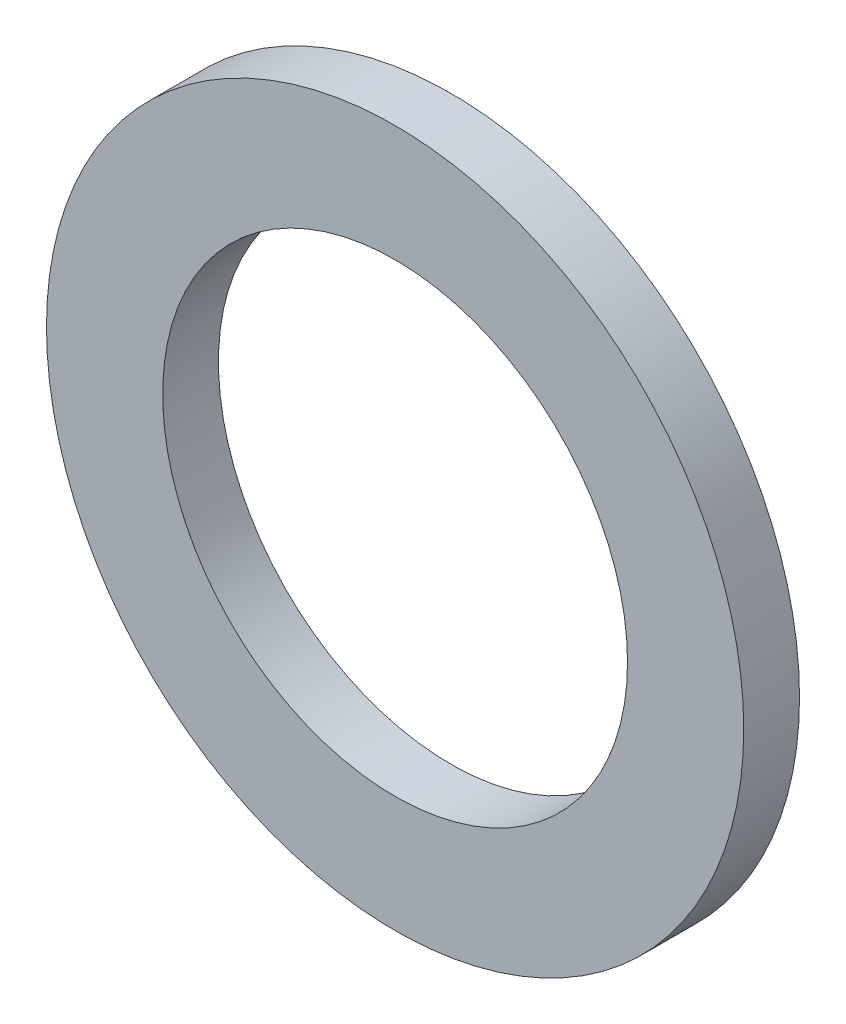
ISO-10303-21;
HEADER;
FILE_DESCRIPTION(('STEP AP214'),'2;1');
FILE_NAME('part.step','',(''),(''),'','','');
FILE_SCHEMA(('AUTOMOTIVE_DESIGN { 1 0 10303 214 1 1 1 1 }'));
ENDSEC;
DATA;
#1=APPLICATION_CONTEXT('core data for automotive mechanical design processes');
#2=APPLICATION_PROTOCOL_DEFINITION('international standard','automotive_design',2000,#1);
#3=PRODUCT_CONTEXT('',#1,'mechanical');
#4=PRODUCT('Part','Part','',(#3));
#5=PRODUCT_RELATED_PRODUCT_CATEGORY('part','',(#4));
#6=PRODUCT_DEFINITION_FORMATION('','',#4);
#7=PRODUCT_DEFINITION_CONTEXT('part definition',#1,'design');
#8=PRODUCT_DEFINITION('design','',#6,#7);
#9=PRODUCT_DEFINITION_SHAPE('','',#8);
#10=(LENGTH_UNIT() NAMED_UNIT(*) SI_UNIT(.MILLI.,.METRE.));
#11=(NAMED_UNIT(*) PLANE_ANGLE_UNIT() SI_UNIT($,.RADIAN.));
#12=(NAMED_UNIT(*) SI_UNIT($,.STERADIAN.) SOLID_ANGLE_UNIT());
#13=UNCERTAINTY_MEASURE_WITH_UNIT(LENGTH_MEASURE(1.E-05),#10,'distance_accuracy_value','');
#14=(GEOMETRIC_REPRESENTATION_CONTEXT(3) GLOBAL_UNCERTAINTY_ASSIGNED_CONTEXT((#13)) GLOBAL_UNIT_ASSIGNED_CONTEXT((#10,
#11,#12)) REPRESENTATION_CONTEXT('',''));
#15=CARTESIAN_POINT('',(0.,0.,0.));
#16=DIRECTION('',(0.,0.,1.));
#17=DIRECTION('',(1.,0.,0.));
#18=AXIS2_PLACEMENT_3D('',#15,#16,#17);
#19=CARTESIAN_POINT('',(0.,0.,0.762));
#20=DIRECTION('',(0.,0.,1.));
#21=DIRECTION('',(1.,0.,0.));
#22=AXIS2_PLACEMENT_3D('',#19,#20,#21);
#23=PLANE('',#22);
#24=CARTESIAN_POINT('',(0.,0.,0.762));
#25=DIRECTION('',(0.,0.,1.));
#26=DIRECTION('',(1.,0.,0.));
#27=AXIS2_PLACEMENT_3D('',#24,#25,#26);
#28=CIRCLE('',#27,4.7625);
#29=CARTESIAN_POINT('',(4.7625,0.,0.762));
#30=VERTEX_POINT('',#29);
#31=EDGE_CURVE('E10',#30,#30,#28,.T.);
#32=ORIENTED_EDGE('',*,*,#31,.T.);
#33=EDGE_LOOP('',(#32));
#34=FACE_BOUND('',#33,.T.);
#35=CARTESIAN_POINT('',(0.,0.,0.762));
#36=DIRECTION('',(0.,0.,1.));
#37=DIRECTION('',(1.,0.,0.));
#38=AXIS2_PLACEMENT_3D('',#35,#36,#37);
#39=CIRCLE('',#38,3.175);
#40=CARTESIAN_POINT('',(3.175,0.,0.762));
#41=VERTEX_POINT('',#40);
#42=EDGE_CURVE('E42',#41,#41,#39,.T.);
#43=ORIENTED_EDGE('',*,*,#42,.F.);
#44=EDGE_LOOP('',(#43));
#45=FACE_BOUND('',#44,.T.);
#46=ADVANCED_FACE('F31',(#34,#45),#23,.T.);
#47=CARTESIAN_POINT('',(0.,0.,0.));
#48=DIRECTION('',(0.,0.,1.));
#49=DIRECTION('',(1.,0.,0.));
#50=AXIS2_PLACEMENT_3D('',#47,#48,#49);
#51=PLANE('',#50);
#52=CARTESIAN_POINT('',(0.,0.,0.));
#53=DIRECTION('',(0.,0.,1.));
#54=DIRECTION('',(1.,0.,0.));
#55=AXIS2_PLACEMENT_3D('',#52,#53,#54);
#56=CIRCLE('',#55,4.7625);
#57=CARTESIAN_POINT('',(4.7625,0.,0.));
#58=VERTEX_POINT('',#57);
#59=EDGE_CURVE('E35',#58,#58,#56,.T.);
#60=ORIENTED_EDGE('',*,*,#59,.F.);
#61=EDGE_LOOP('',(#60));
#62=FACE_BOUND('',#61,.T.);
#63=CARTESIAN_POINT('',(0.,0.,0.));
#64=DIRECTION('',(0.,0.,1.));
#65=DIRECTION('',(1.,0.,0.));
#66=AXIS2_PLACEMENT_3D('',#63,#64,#65);
#67=CIRCLE('',#66,3.175);
#68=CARTESIAN_POINT('',(3.175,0.,0.));
#69=VERTEX_POINT('',#68);
#70=EDGE_CURVE('E44',#69,#69,#67,.T.);
#71=ORIENTED_EDGE('',*,*,#70,.T.);
#72=EDGE_LOOP('',(#71));
#73=FACE_BOUND('',#72,.T.);
#74=ADVANCED_FACE('F54',(#62,#73),#51,.F.);
#75=CARTESIAN_POINT('',(0.,0.,0.762));
#76=DIRECTION('',(0.,0.,-1.));
#77=DIRECTION('',(-1.,0.,0.));
#78=AXIS2_PLACEMENT_3D('',#75,#76,#77);
#79=CYLINDRICAL_SURFACE('',#78,4.7625);
#80=ORIENTED_EDGE('',*,*,#31,.F.);
#81=EDGE_LOOP('',(#80));
#82=FACE_BOUND('',#81,.T.);
#83=ORIENTED_EDGE('',*,*,#59,.T.);
#84=EDGE_LOOP('',(#83));
#85=FACE_BOUND('',#84,.T.);
#86=ADVANCED_FACE('F33',(#82,#85),#79,.T.);
#87=CARTESIAN_POINT('',(0.,0.,0.762));
#88=DIRECTION('',(0.,0.,-1.));
#89=DIRECTION('',(-1.,0.,0.));
#90=AXIS2_PLACEMENT_3D('',#87,#88,#89);
#91=CYLINDRICAL_SURFACE('',#90,3.175);
#92=ORIENTED_EDGE('',*,*,#42,.T.);
#93=EDGE_LOOP('',(#92));
#94=FACE_BOUND('',#93,.T.);
#95=ORIENTED_EDGE('',*,*,#70,.F.);
#96=EDGE_LOOP('',(#95));
#97=FACE_BOUND('',#96,.T.);
#98=ADVANCED_FACE('F50',(#94,#97),#91,.F.);
#99=CLOSED_SHELL('',(#46,#74,#86,#98));
#100=MANIFOLD_SOLID_BREP('B2',#99);
#101=ADVANCED_BREP_SHAPE_REPRESENTATION('',(#18,#100),#14);
#102=SHAPE_DEFINITION_REPRESENTATION(#9,#101);
ENDSEC;
END-ISO-10303-21;
